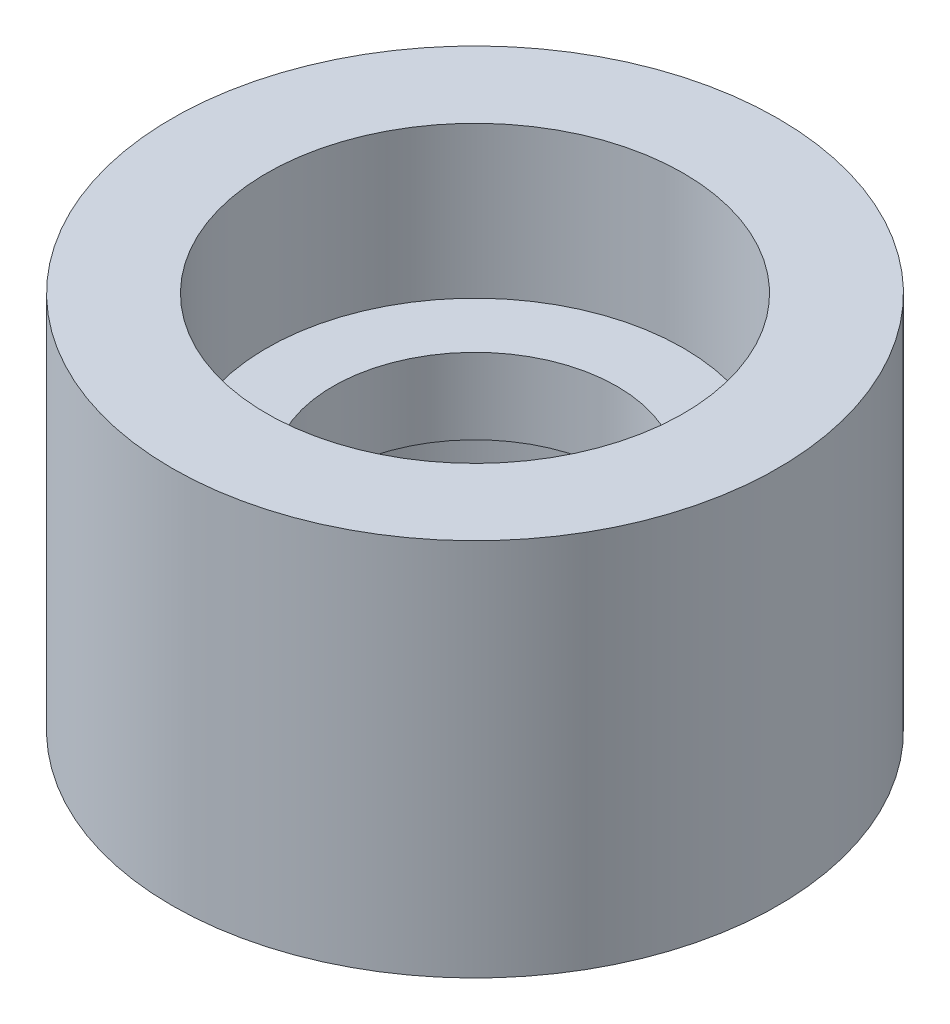
ISO-10303-21;
HEADER;
FILE_DESCRIPTION(('STEP AP214'),'2;1');
FILE_NAME('part.step','',(''),(''),'','','');
FILE_SCHEMA(('AUTOMOTIVE_DESIGN { 1 0 10303 214 1 1 1 1 }'));
ENDSEC;
DATA;
#1=APPLICATION_CONTEXT('core data for automotive mechanical design processes');
#2=APPLICATION_PROTOCOL_DEFINITION('international standard','automotive_design',2000,#1);
#3=PRODUCT_CONTEXT('',#1,'mechanical');
#4=PRODUCT('Part','Part','',(#3));
#5=PRODUCT_RELATED_PRODUCT_CATEGORY('part','',(#4));
#6=PRODUCT_DEFINITION_FORMATION('','',#4);
#7=PRODUCT_DEFINITION_CONTEXT('part definition',#1,'design');
#8=PRODUCT_DEFINITION('design','',#6,#7);
#9=PRODUCT_DEFINITION_SHAPE('','',#8);
#10=(LENGTH_UNIT() NAMED_UNIT(*) SI_UNIT(.MILLI.,.METRE.));
#11=(NAMED_UNIT(*) PLANE_ANGLE_UNIT() SI_UNIT($,.RADIAN.));
#12=(NAMED_UNIT(*) SI_UNIT($,.STERADIAN.) SOLID_ANGLE_UNIT());
#13=UNCERTAINTY_MEASURE_WITH_UNIT(LENGTH_MEASURE(1.E-05),#10,'distance_accuracy_value','');
#14=(GEOMETRIC_REPRESENTATION_CONTEXT(3) GLOBAL_UNCERTAINTY_ASSIGNED_CONTEXT((#13)) GLOBAL_UNIT_ASSIGNED_CONTEXT((#10,
#11,#12)) REPRESENTATION_CONTEXT('',''));
#15=CARTESIAN_POINT('',(0.,0.,0.));
#16=DIRECTION('',(0.,0.,1.));
#17=DIRECTION('',(1.,0.,0.));
#18=AXIS2_PLACEMENT_3D('',#15,#16,#17);
#19=CARTESIAN_POINT('',(0.,0.,0.));
#20=DIRECTION('',(0.,-1.,0.));
#21=DIRECTION('',(0.,0.,-1.));
#22=AXIS2_PLACEMENT_3D('',#19,#20,#21);
#23=CYLINDRICAL_SURFACE('',#22,16.);
#24=CARTESIAN_POINT('',(0.,0.,0.));
#25=DIRECTION('',(0.,-1.,0.));
#26=DIRECTION('',(0.,0.,-1.));
#27=AXIS2_PLACEMENT_3D('',#24,#25,#26);
#28=CIRCLE('',#27,16.);
#29=CARTESIAN_POINT('',(0.,0.,-16.));
#30=VERTEX_POINT('',#29);
#31=EDGE_CURVE('E59',#30,#30,#28,.T.);
#32=ORIENTED_EDGE('',*,*,#31,.F.);
#33=EDGE_LOOP('',(#32));
#34=FACE_BOUND('',#33,.T.);
#35=CARTESIAN_POINT('',(0.,20.,0.));
#36=DIRECTION('',(0.,-1.,0.));
#37=DIRECTION('',(0.,0.,-1.));
#38=AXIS2_PLACEMENT_3D('',#35,#36,#37);
#39=CIRCLE('',#38,16.);
#40=CARTESIAN_POINT('',(0.,20.,-16.));
#41=VERTEX_POINT('',#40);
#42=EDGE_CURVE('E10',#41,#41,#39,.T.);
#43=ORIENTED_EDGE('',*,*,#42,.T.);
#44=EDGE_LOOP('',(#43));
#45=FACE_BOUND('',#44,.T.);
#46=ADVANCED_FACE('F31',(#34,#45),#23,.T.);
#47=CARTESIAN_POINT('',(-16.,20.,0.));
#48=DIRECTION('',(0.,-1.,0.));
#49=DIRECTION('',(0.,0.,-1.));
#50=AXIS2_PLACEMENT_3D('',#47,#48,#49);
#51=PLANE('',#50);
#52=ORIENTED_EDGE('',*,*,#42,.F.);
#53=EDGE_LOOP('',(#52));
#54=FACE_BOUND('',#53,.T.);
#55=CARTESIAN_POINT('',(0.,20.,0.));
#56=DIRECTION('',(0.,-1.,0.));
#57=DIRECTION('',(0.,0.,-1.));
#58=AXIS2_PLACEMENT_3D('',#55,#56,#57);
#59=CIRCLE('',#58,11.);
#60=CARTESIAN_POINT('',(0.,20.,-11.));
#61=VERTEX_POINT('',#60);
#62=EDGE_CURVE('E37',#61,#61,#59,.T.);
#63=ORIENTED_EDGE('',*,*,#62,.T.);
#64=EDGE_LOOP('',(#63));
#65=FACE_BOUND('',#64,.T.);
#66=ADVANCED_FACE('F66',(#54,#65),#51,.F.);
#67=CARTESIAN_POINT('',(0.,0.,0.));
#68=DIRECTION('',(0.,-1.,0.));
#69=DIRECTION('',(0.,0.,-1.));
#70=AXIS2_PLACEMENT_3D('',#67,#68,#69);
#71=CYLINDRICAL_SURFACE('',#70,11.);
#72=ORIENTED_EDGE('',*,*,#62,.F.);
#73=EDGE_LOOP('',(#72));
#74=FACE_BOUND('',#73,.T.);
#75=CARTESIAN_POINT('',(0.,12.,0.));
#76=DIRECTION('',(0.,-1.,0.));
#77=DIRECTION('',(0.,0.,-1.));
#78=AXIS2_PLACEMENT_3D('',#75,#76,#77);
#79=CIRCLE('',#78,11.);
#80=CARTESIAN_POINT('',(0.,12.,-11.));
#81=VERTEX_POINT('',#80);
#82=EDGE_CURVE('E41',#81,#81,#79,.T.);
#83=ORIENTED_EDGE('',*,*,#82,.T.);
#84=EDGE_LOOP('',(#83));
#85=FACE_BOUND('',#84,.T.);
#86=ADVANCED_FACE('F70',(#74,#85),#71,.F.);
#87=CARTESIAN_POINT('',(-11.,12.,0.));
#88=DIRECTION('',(0.,-1.,0.));
#89=DIRECTION('',(0.,0.,-1.));
#90=AXIS2_PLACEMENT_3D('',#87,#88,#89);
#91=PLANE('',#90);
#92=ORIENTED_EDGE('',*,*,#82,.F.);
#93=EDGE_LOOP('',(#92));
#94=FACE_BOUND('',#93,.T.);
#95=CARTESIAN_POINT('',(0.,12.,0.));
#96=DIRECTION('',(0.,-1.,0.));
#97=DIRECTION('',(0.,0.,-1.));
#98=AXIS2_PLACEMENT_3D('',#95,#96,#97);
#99=CIRCLE('',#98,7.5);
#100=CARTESIAN_POINT('',(0.,12.,-7.5));
#101=VERTEX_POINT('',#100);
#102=EDGE_CURVE('E45',#101,#101,#99,.T.);
#103=ORIENTED_EDGE('',*,*,#102,.T.);
#104=EDGE_LOOP('',(#103));
#105=FACE_BOUND('',#104,.T.);
#106=ADVANCED_FACE('F75',(#94,#105),#91,.F.);
#107=CARTESIAN_POINT('',(0.,0.,0.));
#108=DIRECTION('',(0.,-1.,0.));
#109=DIRECTION('',(0.,0.,-1.));
#110=AXIS2_PLACEMENT_3D('',#107,#108,#109);
#111=CYLINDRICAL_SURFACE('',#110,7.5);
#112=ORIENTED_EDGE('',*,*,#102,.F.);
#113=EDGE_LOOP('',(#112));
#114=FACE_BOUND('',#113,.T.);
#115=CARTESIAN_POINT('',(0.,8.,0.));
#116=DIRECTION('',(0.,-1.,0.));
#117=DIRECTION('',(0.,0.,-1.));
#118=AXIS2_PLACEMENT_3D('',#115,#116,#117);
#119=CIRCLE('',#118,7.5);
#120=CARTESIAN_POINT('',(0.,8.,-7.5));
#121=VERTEX_POINT('',#120);
#122=EDGE_CURVE('E50',#121,#121,#119,.T.);
#123=ORIENTED_EDGE('',*,*,#122,.T.);
#124=EDGE_LOOP('',(#123));
#125=FACE_BOUND('',#124,.T.);
#126=ADVANCED_FACE('F81',(#114,#125),#111,.F.);
#127=CARTESIAN_POINT('',(-7.5,8.,0.));
#128=DIRECTION('',(0.,1.,0.));
#129=DIRECTION('',(0.,0.,1.));
#130=AXIS2_PLACEMENT_3D('',#127,#128,#129);
#131=PLANE('',#130);
#132=ORIENTED_EDGE('',*,*,#122,.F.);
#133=EDGE_LOOP('',(#132));
#134=FACE_BOUND('',#133,.T.);
#135=CARTESIAN_POINT('',(0.,8.,0.));
#136=DIRECTION('',(0.,-1.,0.));
#137=DIRECTION('',(0.,0.,-1.));
#138=AXIS2_PLACEMENT_3D('',#135,#136,#137);
#139=CIRCLE('',#138,11.);
#140=CARTESIAN_POINT('',(0.,8.,-11.));
#141=VERTEX_POINT('',#140);
#142=EDGE_CURVE('E53',#141,#141,#139,.T.);
#143=ORIENTED_EDGE('',*,*,#142,.T.);
#144=EDGE_LOOP('',(#143));
#145=FACE_BOUND('',#144,.T.);
#146=ADVANCED_FACE('F85',(#134,#145),#131,.F.);
#147=CARTESIAN_POINT('',(0.,0.,0.));
#148=DIRECTION('',(0.,-1.,0.));
#149=DIRECTION('',(0.,0.,-1.));
#150=AXIS2_PLACEMENT_3D('',#147,#148,#149);
#151=CYLINDRICAL_SURFACE('',#150,11.);
#152=ORIENTED_EDGE('',*,*,#142,.F.);
#153=EDGE_LOOP('',(#152));
#154=FACE_BOUND('',#153,.T.);
#155=CARTESIAN_POINT('',(0.,0.,0.));
#156=DIRECTION('',(0.,-1.,0.));
#157=DIRECTION('',(0.,0.,-1.));
#158=AXIS2_PLACEMENT_3D('',#155,#156,#157);
#159=CIRCLE('',#158,11.);
#160=CARTESIAN_POINT('',(0.,0.,-11.));
#161=VERTEX_POINT('',#160);
#162=EDGE_CURVE('E56',#161,#161,#159,.T.);
#163=ORIENTED_EDGE('',*,*,#162,.T.);
#164=EDGE_LOOP('',(#163));
#165=FACE_BOUND('',#164,.T.);
#166=ADVANCED_FACE('F89',(#154,#165),#151,.F.);
#167=CARTESIAN_POINT('',(-11.,0.,0.));
#168=DIRECTION('',(0.,1.,0.));
#169=DIRECTION('',(0.,0.,1.));
#170=AXIS2_PLACEMENT_3D('',#167,#168,#169);
#171=PLANE('',#170);
#172=ORIENTED_EDGE('',*,*,#162,.F.);
#173=EDGE_LOOP('',(#172));
#174=FACE_BOUND('',#173,.T.);
#175=ORIENTED_EDGE('',*,*,#31,.T.);
#176=EDGE_LOOP('',(#175));
#177=FACE_BOUND('',#176,.T.);
#178=ADVANCED_FACE('F63',(#174,#177),#171,.F.);
#179=CLOSED_SHELL('',(#46,#66,#86,#106,#126,#146,#166,#178));
#180=MANIFOLD_SOLID_BREP('B2',#179);
#181=ADVANCED_BREP_SHAPE_REPRESENTATION('',(#18,#180),#14);
#182=SHAPE_DEFINITION_REPRESENTATION(#9,#181);
ENDSEC;
END-ISO-10303-21;
